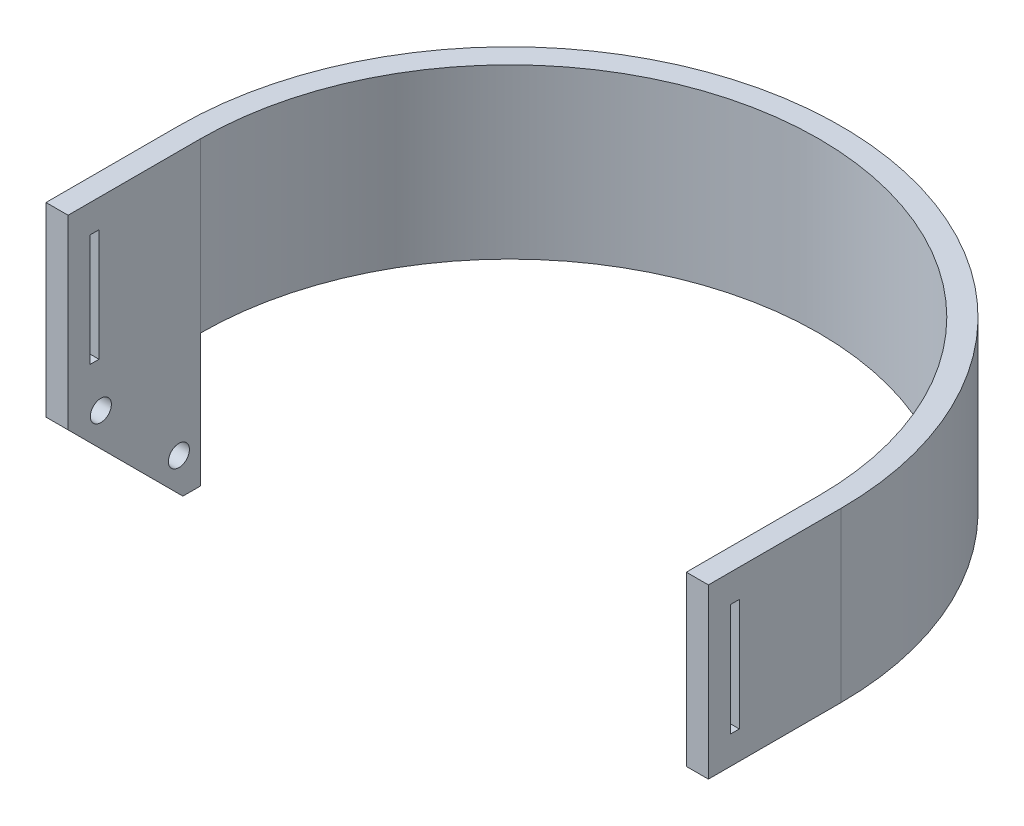
ISO-10303-21;
HEADER;
FILE_DESCRIPTION(('STEP AP214'),'2;1');
FILE_NAME('part.step','',(''),(''),'','','');
FILE_SCHEMA(('AUTOMOTIVE_DESIGN { 1 0 10303 214 1 1 1 1 }'));
ENDSEC;
DATA;
#1=APPLICATION_CONTEXT('core data for automotive mechanical design processes');
#2=APPLICATION_PROTOCOL_DEFINITION('international standard','automotive_design',2000,#1);
#3=PRODUCT_CONTEXT('',#1,'mechanical');
#4=PRODUCT('Part','Part','',(#3));
#5=PRODUCT_RELATED_PRODUCT_CATEGORY('part','',(#4));
#6=PRODUCT_DEFINITION_FORMATION('','',#4);
#7=PRODUCT_DEFINITION_CONTEXT('part definition',#1,'design');
#8=PRODUCT_DEFINITION('design','',#6,#7);
#9=PRODUCT_DEFINITION_SHAPE('','',#8);
#10=(LENGTH_UNIT() NAMED_UNIT(*) SI_UNIT(.MILLI.,.METRE.));
#11=(NAMED_UNIT(*) PLANE_ANGLE_UNIT() SI_UNIT($,.RADIAN.));
#12=(NAMED_UNIT(*) SI_UNIT($,.STERADIAN.) SOLID_ANGLE_UNIT());
#13=UNCERTAINTY_MEASURE_WITH_UNIT(LENGTH_MEASURE(1.E-05),#10,'distance_accuracy_value','');
#14=(GEOMETRIC_REPRESENTATION_CONTEXT(3) GLOBAL_UNCERTAINTY_ASSIGNED_CONTEXT((#13)) GLOBAL_UNIT_ASSIGNED_CONTEXT((#10,
#11,#12)) REPRESENTATION_CONTEXT('',''));
#15=CARTESIAN_POINT('',(0.,0.,0.));
#16=DIRECTION('',(0.,0.,1.));
#17=DIRECTION('',(1.,0.,0.));
#18=AXIS2_PLACEMENT_3D('',#15,#16,#17);
#19=CARTESIAN_POINT('',(0.,38.1,30.));
#20=DIRECTION('',(0.,0.,-1.));
#21=DIRECTION('',(-1.,0.,0.));
#22=AXIS2_PLACEMENT_3D('',#19,#20,#21);
#23=PLANE('',#22);
#24=DIRECTION('',(0.,-1.,0.));
#25=VECTOR('',#24,1.);
#26=CARTESIAN_POINT('',(70.,38.1,30.));
#27=LINE('',#26,#25);
#28=CARTESIAN_POINT('',(70.,38.1,30.));
#29=VERTEX_POINT('',#28);
#30=CARTESIAN_POINT('',(70.,0.,30.));
#31=VERTEX_POINT('',#30);
#32=EDGE_CURVE('E342',#29,#31,#27,.T.);
#33=ORIENTED_EDGE('',*,*,#32,.T.);
#34=DIRECTION('',(1.,0.,0.));
#35=VECTOR('',#34,1.);
#36=CARTESIAN_POINT('',(0.,0.,30.));
#37=LINE('',#36,#35);
#38=CARTESIAN_POINT('',(75.,0.,30.));
#39=VERTEX_POINT('',#38);
#40=EDGE_CURVE('E383',#31,#39,#37,.T.);
#41=ORIENTED_EDGE('',*,*,#40,.T.);
#42=DIRECTION('',(0.,-1.,0.));
#43=VECTOR('',#42,1.);
#44=CARTESIAN_POINT('',(75.,38.1,30.));
#45=LINE('',#44,#43);
#46=CARTESIAN_POINT('',(75.,38.1,30.));
#47=VERTEX_POINT('',#46);
#48=EDGE_CURVE('E338',#47,#39,#45,.T.);
#49=ORIENTED_EDGE('',*,*,#48,.F.);
#50=DIRECTION('',(1.,0.,0.));
#51=VECTOR('',#50,1.);
#52=CARTESIAN_POINT('',(0.,38.1,30.));
#53=LINE('',#52,#51);
#54=EDGE_CURVE('E305',#29,#47,#53,.T.);
#55=ORIENTED_EDGE('',*,*,#54,.F.);
#56=EDGE_LOOP('',(#33,#41,#49,#55));
#57=FACE_BOUND('',#56,.T.);
#58=ADVANCED_FACE('F43',(#57),#23,.F.);
#59=CARTESIAN_POINT('',(0.,0.,0.));
#60=DIRECTION('',(0.,1.,0.));
#61=DIRECTION('',(0.,0.,1.));
#62=AXIS2_PLACEMENT_3D('',#59,#60,#61);
#63=PLANE('',#62);
#64=DIRECTION('',(1.,0.,0.));
#65=VECTOR('',#64,1.);
#66=CARTESIAN_POINT('',(-75.,0.,0.));
#67=LINE('',#66,#65);
#68=CARTESIAN_POINT('',(-75.,0.,0.));
#69=VERTEX_POINT('',#68);
#70=CARTESIAN_POINT('',(-70.,0.,0.));
#71=VERTEX_POINT('',#70);
#72=EDGE_CURVE('E186',#69,#71,#67,.T.);
#73=ORIENTED_EDGE('',*,*,#72,.F.);
#74=CARTESIAN_POINT('',(0.,0.,0.));
#75=DIRECTION('',(0.,1.,0.));
#76=DIRECTION('',(0.,0.,1.));
#77=AXIS2_PLACEMENT_3D('',#74,#75,#76);
#78=CIRCLE('',#77,75.);
#79=CARTESIAN_POINT('',(75.,0.,0.));
#80=VERTEX_POINT('',#79);
#81=EDGE_CURVE('E299',#80,#69,#78,.T.);
#82=ORIENTED_EDGE('',*,*,#81,.F.);
#83=DIRECTION('',(0.,0.,1.));
#84=VECTOR('',#83,1.);
#85=CARTESIAN_POINT('',(75.,0.,0.));
#86=LINE('',#85,#84);
#87=EDGE_CURVE('E179',#80,#39,#86,.T.);
#88=ORIENTED_EDGE('',*,*,#87,.T.);
#89=ORIENTED_EDGE('',*,*,#40,.F.);
#90=DIRECTION('',(0.,0.,1.));
#91=VECTOR('',#90,1.);
#92=CARTESIAN_POINT('',(70.,0.,0.));
#93=LINE('',#92,#91);
#94=CARTESIAN_POINT('',(70.,0.,0.));
#95=VERTEX_POINT('',#94);
#96=EDGE_CURVE('E189',#95,#31,#93,.T.);
#97=ORIENTED_EDGE('',*,*,#96,.F.);
#98=CARTESIAN_POINT('',(0.,0.,0.));
#99=DIRECTION('',(0.,1.,0.));
#100=DIRECTION('',(0.,0.,1.));
#101=AXIS2_PLACEMENT_3D('',#98,#99,#100);
#102=CIRCLE('',#101,70.);
#103=EDGE_CURVE('E183',#95,#71,#102,.T.);
#104=ORIENTED_EDGE('',*,*,#103,.T.);
#105=EDGE_LOOP('',(#73,#82,#88,#89,#97,#104));
#106=FACE_BOUND('',#105,.T.);
#107=ADVANCED_FACE('F184',(#106),#63,.F.);
#108=CARTESIAN_POINT('',(-70.,38.1,0.));
#109=DIRECTION('',(1.,0.,0.));
#110=DIRECTION('',(0.,0.,-1.));
#111=AXIS2_PLACEMENT_3D('',#108,#109,#110);
#112=PLANE('',#111);
#113=DIRECTION('',(0.,-1.,0.));
#114=VECTOR('',#113,1.);
#115=CARTESIAN_POINT('',(-70.,38.1,25.));
#116=LINE('',#115,#114);
#117=CARTESIAN_POINT('',(-70.,31.75,25.));
#118=VERTEX_POINT('',#117);
#119=CARTESIAN_POINT('',(-70.,6.35,25.));
#120=VERTEX_POINT('',#119);
#121=EDGE_CURVE('E193',#118,#120,#116,.T.);
#122=ORIENTED_EDGE('',*,*,#121,.F.);
#123=DIRECTION('',(0.,0.,1.));
#124=VECTOR('',#123,1.);
#125=CARTESIAN_POINT('',(-70.,31.75,0.));
#126=LINE('',#125,#124);
#127=CARTESIAN_POINT('',(-70.,31.75,23.));
#128=VERTEX_POINT('',#127);
#129=EDGE_CURVE('E287',#128,#118,#126,.T.);
#130=ORIENTED_EDGE('',*,*,#129,.F.);
#131=DIRECTION('',(0.,1.,0.));
#132=VECTOR('',#131,1.);
#133=CARTESIAN_POINT('',(-70.,38.1,23.));
#134=LINE('',#133,#132);
#135=CARTESIAN_POINT('',(-70.,6.35,23.));
#136=VERTEX_POINT('',#135);
#137=EDGE_CURVE('E280',#136,#128,#134,.T.);
#138=ORIENTED_EDGE('',*,*,#137,.F.);
#139=DIRECTION('',(0.,0.,-1.));
#140=VECTOR('',#139,1.);
#141=CARTESIAN_POINT('',(-70.,6.35,0.));
#142=LINE('',#141,#140);
#143=EDGE_CURVE('E273',#120,#136,#142,.T.);
#144=ORIENTED_EDGE('',*,*,#143,.F.);
#145=EDGE_LOOP('',(#122,#130,#138,#144));
#146=FACE_BOUND('',#145,.T.);
#147=DIRECTION('',(0.,-1.,0.));
#148=VECTOR('',#147,1.);
#149=CARTESIAN_POINT('',(-70.,38.1,30.));
#150=LINE('',#149,#148);
#151=CARTESIAN_POINT('',(-70.,38.1,30.));
#152=VERTEX_POINT('',#151);
#153=CARTESIAN_POINT('',(-70.,-3.99999999999999,30.));
#154=VERTEX_POINT('',#153);
#155=EDGE_CURVE('E58',#152,#154,#150,.T.);
#156=ORIENTED_EDGE('',*,*,#155,.T.);
#157=DIRECTION('',(0.,-0.707106781186548,-0.707106781186548));
#158=VECTOR('',#157,1.);
#159=CARTESIAN_POINT('',(-70.,-17.,17.));
#160=LINE('',#159,#158);
#161=CARTESIAN_POINT('',(-70.,-30.,3.99999999999999));
#162=VERTEX_POINT('',#161);
#163=EDGE_CURVE('E11',#154,#162,#160,.T.);
#164=ORIENTED_EDGE('',*,*,#163,.T.);
#165=DIRECTION('',(0.,0.,-1.));
#166=VECTOR('',#165,1.);
#167=CARTESIAN_POINT('',(-70.,-30.,0.));
#168=LINE('',#167,#166);
#169=CARTESIAN_POINT('',(-70.,-30.,0.));
#170=VERTEX_POINT('',#169);
#171=EDGE_CURVE('E173',#162,#170,#168,.T.);
#172=ORIENTED_EDGE('',*,*,#171,.T.);
#173=DIRECTION('',(0.,1.,0.));
#174=VECTOR('',#173,1.);
#175=CARTESIAN_POINT('',(-70.,0.,0.));
#176=LINE('',#175,#174);
#177=EDGE_CURVE('E167',#170,#71,#176,.T.);
#178=ORIENTED_EDGE('',*,*,#177,.T.);
#179=DIRECTION('',(0.,-1.,0.));
#180=VECTOR('',#179,1.);
#181=CARTESIAN_POINT('',(-70.,38.1,0.));
#182=LINE('',#181,#180);
#183=CARTESIAN_POINT('',(-70.,38.1,0.));
#184=VERTEX_POINT('',#183);
#185=EDGE_CURVE('E52',#184,#71,#182,.T.);
#186=ORIENTED_EDGE('',*,*,#185,.F.);
#187=DIRECTION('',(0.,0.,1.));
#188=VECTOR('',#187,1.);
#189=CARTESIAN_POINT('',(-70.,38.1,0.));
#190=LINE('',#189,#188);
#191=EDGE_CURVE('E296',#184,#152,#190,.T.);
#192=ORIENTED_EDGE('',*,*,#191,.T.);
#193=EDGE_LOOP('',(#156,#164,#172,#178,#186,#192));
#194=FACE_BOUND('',#193,.T.);
#195=CARTESIAN_POINT('',(-70.,-21.5667568261897,4.89770926787757));
#196=DIRECTION('',(-1.,0.,0.));
#197=DIRECTION('',(0.,0.,1.));
#198=AXIS2_PLACEMENT_3D('',#195,#196,#197);
#199=CIRCLE('',#198,2.38125);
#200=CARTESIAN_POINT('',(-70.,-21.5667568261897,7.27895926787757));
#201=VERTEX_POINT('',#200);
#202=EDGE_CURVE('E391',#201,#201,#199,.F.);
#203=ORIENTED_EDGE('',*,*,#202,.F.);
#204=EDGE_LOOP('',(#203));
#205=FACE_BOUND('',#204,.T.);
#206=CARTESIAN_POINT('',(-70.,-3.88908729652603,22.5753787975413));
#207=DIRECTION('',(-1.,0.,0.));
#208=DIRECTION('',(0.,0.,1.));
#209=AXIS2_PLACEMENT_3D('',#206,#207,#208);
#210=CIRCLE('',#209,2.38125);
#211=CARTESIAN_POINT('',(-70.,-3.88908729652603,24.9566287975413));
#212=VERTEX_POINT('',#211);
#213=EDGE_CURVE('E387',#212,#212,#210,.F.);
#214=ORIENTED_EDGE('',*,*,#213,.F.);
#215=EDGE_LOOP('',(#214));
#216=FACE_BOUND('',#215,.T.);
#217=ADVANCED_FACE('F45',(#146,#194,#205,#216),#112,.T.);
#218=CARTESIAN_POINT('',(0.,38.1,0.));
#219=DIRECTION('',(0.,-1.,0.));
#220=DIRECTION('',(0.,0.,-1.));
#221=AXIS2_PLACEMENT_3D('',#218,#219,#220);
#222=CYLINDRICAL_SURFACE('',#221,70.);
#223=ORIENTED_EDGE('',*,*,#103,.F.);
#224=DIRECTION('',(0.,-1.,0.));
#225=VECTOR('',#224,1.);
#226=CARTESIAN_POINT('',(70.,38.1,0.));
#227=LINE('',#226,#225);
#228=CARTESIAN_POINT('',(70.,38.1,0.));
#229=VERTEX_POINT('',#228);
#230=EDGE_CURVE('E200',#229,#95,#227,.T.);
#231=ORIENTED_EDGE('',*,*,#230,.F.);
#232=CARTESIAN_POINT('',(0.,38.1,0.));
#233=DIRECTION('',(0.,1.,0.));
#234=DIRECTION('',(0.,0.,1.));
#235=AXIS2_PLACEMENT_3D('',#232,#233,#234);
#236=CIRCLE('',#235,70.);
#237=EDGE_CURVE('E198',#229,#184,#236,.T.);
#238=ORIENTED_EDGE('',*,*,#237,.T.);
#239=ORIENTED_EDGE('',*,*,#185,.T.);
#240=EDGE_LOOP('',(#223,#231,#238,#239));
#241=FACE_BOUND('',#240,.T.);
#242=ADVANCED_FACE('F196',(#241),#222,.F.);
#243=CARTESIAN_POINT('',(70.,38.1,0.));
#244=DIRECTION('',(1.,0.,0.));
#245=DIRECTION('',(0.,0.,-1.));
#246=AXIS2_PLACEMENT_3D('',#243,#244,#245);
#247=PLANE('',#246);
#248=DIRECTION('',(0.,0.,1.));
#249=VECTOR('',#248,1.);
#250=CARTESIAN_POINT('',(70.,31.75,0.));
#251=LINE('',#250,#249);
#252=CARTESIAN_POINT('',(70.,31.75,23.));
#253=VERTEX_POINT('',#252);
#254=CARTESIAN_POINT('',(70.,31.75,25.));
#255=VERTEX_POINT('',#254);
#256=EDGE_CURVE('E283',#253,#255,#251,.T.);
#257=ORIENTED_EDGE('',*,*,#256,.T.);
#258=DIRECTION('',(0.,-1.,0.));
#259=VECTOR('',#258,1.);
#260=CARTESIAN_POINT('',(70.,38.1,25.));
#261=LINE('',#260,#259);
#262=CARTESIAN_POINT('',(70.,6.35,25.));
#263=VERTEX_POINT('',#262);
#264=EDGE_CURVE('E290',#255,#263,#261,.T.);
#265=ORIENTED_EDGE('',*,*,#264,.T.);
#266=DIRECTION('',(0.,0.,-1.));
#267=VECTOR('',#266,1.);
#268=CARTESIAN_POINT('',(70.,6.35,0.));
#269=LINE('',#268,#267);
#270=CARTESIAN_POINT('',(70.,6.35,23.));
#271=VERTEX_POINT('',#270);
#272=EDGE_CURVE('E256',#263,#271,#269,.T.);
#273=ORIENTED_EDGE('',*,*,#272,.T.);
#274=DIRECTION('',(0.,1.,0.));
#275=VECTOR('',#274,1.);
#276=CARTESIAN_POINT('',(70.,38.1,23.));
#277=LINE('',#276,#275);
#278=EDGE_CURVE('E276',#271,#253,#277,.T.);
#279=ORIENTED_EDGE('',*,*,#278,.T.);
#280=EDGE_LOOP('',(#257,#265,#273,#279));
#281=FACE_BOUND('',#280,.T.);
#282=ORIENTED_EDGE('',*,*,#96,.T.);
#283=ORIENTED_EDGE('',*,*,#32,.F.);
#284=DIRECTION('',(0.,0.,1.));
#285=VECTOR('',#284,1.);
#286=CARTESIAN_POINT('',(70.,38.1,0.));
#287=LINE('',#286,#285);
#288=EDGE_CURVE('E302',#229,#29,#287,.T.);
#289=ORIENTED_EDGE('',*,*,#288,.F.);
#290=ORIENTED_EDGE('',*,*,#230,.T.);
#291=EDGE_LOOP('',(#282,#283,#289,#290));
#292=FACE_BOUND('',#291,.T.);
#293=ADVANCED_FACE('F349',(#281,#292),#247,.F.);
#294=CARTESIAN_POINT('',(75.,38.1,0.));
#295=DIRECTION('',(1.,0.,0.));
#296=DIRECTION('',(0.,0.,-1.));
#297=AXIS2_PLACEMENT_3D('',#294,#295,#296);
#298=PLANE('',#297);
#299=ORIENTED_EDGE('',*,*,#87,.F.);
#300=DIRECTION('',(0.,-1.,0.));
#301=VECTOR('',#300,1.);
#302=CARTESIAN_POINT('',(75.,38.1,0.));
#303=LINE('',#302,#301);
#304=CARTESIAN_POINT('',(75.,38.1,0.));
#305=VERTEX_POINT('',#304);
#306=EDGE_CURVE('E334',#305,#80,#303,.T.);
#307=ORIENTED_EDGE('',*,*,#306,.F.);
#308=DIRECTION('',(0.,0.,1.));
#309=VECTOR('',#308,1.);
#310=CARTESIAN_POINT('',(75.,38.1,0.));
#311=LINE('',#310,#309);
#312=EDGE_CURVE('E308',#305,#47,#311,.T.);
#313=ORIENTED_EDGE('',*,*,#312,.T.);
#314=ORIENTED_EDGE('',*,*,#48,.T.);
#315=EDGE_LOOP('',(#299,#307,#313,#314));
#316=FACE_BOUND('',#315,.T.);
#317=DIRECTION('',(0.,-1.,0.));
#318=VECTOR('',#317,1.);
#319=CARTESIAN_POINT('',(75.,31.75,25.));
#320=LINE('',#319,#318);
#321=CARTESIAN_POINT('',(75.,31.75,25.));
#322=VERTEX_POINT('',#321);
#323=CARTESIAN_POINT('',(75.,6.35,25.));
#324=VERTEX_POINT('',#323);
#325=EDGE_CURVE('E205',#322,#324,#320,.T.);
#326=ORIENTED_EDGE('',*,*,#325,.F.);
#327=DIRECTION('',(0.,0.,1.));
#328=VECTOR('',#327,1.);
#329=CARTESIAN_POINT('',(75.,31.75,25.));
#330=LINE('',#329,#328);
#331=CARTESIAN_POINT('',(75.,31.75,23.));
#332=VERTEX_POINT('',#331);
#333=EDGE_CURVE('E229',#332,#322,#330,.T.);
#334=ORIENTED_EDGE('',*,*,#333,.F.);
#335=DIRECTION('',(0.,1.,0.));
#336=VECTOR('',#335,1.);
#337=CARTESIAN_POINT('',(75.,31.75,23.));
#338=LINE('',#337,#336);
#339=CARTESIAN_POINT('',(75.,6.35,23.));
#340=VERTEX_POINT('',#339);
#341=EDGE_CURVE('E245',#340,#332,#338,.T.);
#342=ORIENTED_EDGE('',*,*,#341,.F.);
#343=DIRECTION('',(0.,0.,-1.));
#344=VECTOR('',#343,1.);
#345=CARTESIAN_POINT('',(75.,6.35,25.));
#346=LINE('',#345,#344);
#347=EDGE_CURVE('E210',#324,#340,#346,.T.);
#348=ORIENTED_EDGE('',*,*,#347,.F.);
#349=EDGE_LOOP('',(#326,#334,#342,#348));
#350=FACE_BOUND('',#349,.T.);
#351=ADVANCED_FACE('F401',(#316,#350),#298,.T.);
#352=CARTESIAN_POINT('',(0.,38.1,0.));
#353=DIRECTION('',(0.,-1.,0.));
#354=DIRECTION('',(0.,0.,-1.));
#355=AXIS2_PLACEMENT_3D('',#352,#353,#354);
#356=CYLINDRICAL_SURFACE('',#355,75.);
#357=ORIENTED_EDGE('',*,*,#81,.T.);
#358=DIRECTION('',(0.,-1.,0.));
#359=VECTOR('',#358,1.);
#360=CARTESIAN_POINT('',(-75.,38.1,0.));
#361=LINE('',#360,#359);
#362=CARTESIAN_POINT('',(-75.,38.1,0.));
#363=VERTEX_POINT('',#362);
#364=EDGE_CURVE('E330',#363,#69,#361,.T.);
#365=ORIENTED_EDGE('',*,*,#364,.F.);
#366=CARTESIAN_POINT('',(0.,38.1,0.));
#367=DIRECTION('',(0.,1.,0.));
#368=DIRECTION('',(0.,0.,1.));
#369=AXIS2_PLACEMENT_3D('',#366,#367,#368);
#370=CIRCLE('',#369,75.);
#371=EDGE_CURVE('E312',#305,#363,#370,.T.);
#372=ORIENTED_EDGE('',*,*,#371,.F.);
#373=ORIENTED_EDGE('',*,*,#306,.T.);
#374=EDGE_LOOP('',(#357,#365,#372,#373));
#375=FACE_BOUND('',#374,.T.);
#376=ADVANCED_FACE('F407',(#375),#356,.T.);
#377=CARTESIAN_POINT('',(-75.,38.1,0.));
#378=DIRECTION('',(1.,0.,0.));
#379=DIRECTION('',(0.,0.,-1.));
#380=AXIS2_PLACEMENT_3D('',#377,#378,#379);
#381=PLANE('',#380);
#382=DIRECTION('',(0.,0.,1.));
#383=VECTOR('',#382,1.);
#384=CARTESIAN_POINT('',(-75.,31.75,25.));
#385=LINE('',#384,#383);
#386=CARTESIAN_POINT('',(-75.,31.75,23.));
#387=VERTEX_POINT('',#386);
#388=CARTESIAN_POINT('',(-75.,31.75,25.));
#389=VERTEX_POINT('',#388);
#390=EDGE_CURVE('E237',#387,#389,#385,.T.);
#391=ORIENTED_EDGE('',*,*,#390,.T.);
#392=DIRECTION('',(0.,-1.,0.));
#393=VECTOR('',#392,1.);
#394=CARTESIAN_POINT('',(-75.,31.75,25.));
#395=LINE('',#394,#393);
#396=CARTESIAN_POINT('',(-75.,6.35,25.));
#397=VERTEX_POINT('',#396);
#398=EDGE_CURVE('E224',#389,#397,#395,.T.);
#399=ORIENTED_EDGE('',*,*,#398,.T.);
#400=DIRECTION('',(0.,0.,-1.));
#401=VECTOR('',#400,1.);
#402=CARTESIAN_POINT('',(-75.,6.35,25.));
#403=LINE('',#402,#401);
#404=CARTESIAN_POINT('',(-75.,6.35,23.));
#405=VERTEX_POINT('',#404);
#406=EDGE_CURVE('E228',#397,#405,#403,.T.);
#407=ORIENTED_EDGE('',*,*,#406,.T.);
#408=DIRECTION('',(0.,1.,0.));
#409=VECTOR('',#408,1.);
#410=CARTESIAN_POINT('',(-75.,31.75,23.));
#411=LINE('',#410,#409);
#412=EDGE_CURVE('E233',#405,#387,#411,.T.);
#413=ORIENTED_EDGE('',*,*,#412,.T.);
#414=EDGE_LOOP('',(#391,#399,#407,#413));
#415=FACE_BOUND('',#414,.T.);
#416=ORIENTED_EDGE('',*,*,#364,.T.);
#417=DIRECTION('',(0.,-1.,0.));
#418=VECTOR('',#417,1.);
#419=CARTESIAN_POINT('',(-75.,0.,0.));
#420=LINE('',#419,#418);
#421=CARTESIAN_POINT('',(-75.,-30.,0.));
#422=VERTEX_POINT('',#421);
#423=EDGE_CURVE('E203',#69,#422,#420,.T.);
#424=ORIENTED_EDGE('',*,*,#423,.T.);
#425=DIRECTION('',(0.,0.,-1.));
#426=VECTOR('',#425,1.);
#427=CARTESIAN_POINT('',(-75.,-30.,0.));
#428=LINE('',#427,#426);
#429=CARTESIAN_POINT('',(-75.,-30.,3.99999999999999));
#430=VERTEX_POINT('',#429);
#431=EDGE_CURVE('E370',#430,#422,#428,.T.);
#432=ORIENTED_EDGE('',*,*,#431,.F.);
#433=DIRECTION('',(0.,-0.707106781186548,-0.707106781186548));
#434=VECTOR('',#433,1.);
#435=CARTESIAN_POINT('',(-75.,-17.,17.));
#436=LINE('',#435,#434);
#437=CARTESIAN_POINT('',(-75.,-3.99999999999999,30.));
#438=VERTEX_POINT('',#437);
#439=EDGE_CURVE('E364',#438,#430,#436,.T.);
#440=ORIENTED_EDGE('',*,*,#439,.F.);
#441=DIRECTION('',(0.,-1.,0.));
#442=VECTOR('',#441,1.);
#443=CARTESIAN_POINT('',(-75.,38.1,30.));
#444=LINE('',#443,#442);
#445=CARTESIAN_POINT('',(-75.,38.1,30.));
#446=VERTEX_POINT('',#445);
#447=EDGE_CURVE('E327',#446,#438,#444,.T.);
#448=ORIENTED_EDGE('',*,*,#447,.F.);
#449=DIRECTION('',(0.,0.,1.));
#450=VECTOR('',#449,1.);
#451=CARTESIAN_POINT('',(-75.,38.1,0.));
#452=LINE('',#451,#450);
#453=EDGE_CURVE('E315',#363,#446,#452,.T.);
#454=ORIENTED_EDGE('',*,*,#453,.F.);
#455=EDGE_LOOP('',(#416,#424,#432,#440,#448,#454));
#456=FACE_BOUND('',#455,.T.);
#457=CARTESIAN_POINT('',(-75.,-21.5667568261897,4.89770926787757));
#458=DIRECTION('',(1.,0.,0.));
#459=DIRECTION('',(0.,0.,-1.));
#460=AXIS2_PLACEMENT_3D('',#457,#458,#459);
#461=CIRCLE('',#460,2.38125);
#462=CARTESIAN_POINT('',(-75.,-21.5667568261897,2.51645926787756));
#463=VERTEX_POINT('',#462);
#464=EDGE_CURVE('E377',#463,#463,#461,.T.);
#465=ORIENTED_EDGE('',*,*,#464,.T.);
#466=EDGE_LOOP('',(#465));
#467=FACE_BOUND('',#466,.T.);
#468=CARTESIAN_POINT('',(-75.,-3.88908729652603,22.5753787975413));
#469=DIRECTION('',(1.,0.,0.));
#470=DIRECTION('',(0.,0.,-1.));
#471=AXIS2_PLACEMENT_3D('',#468,#469,#470);
#472=CIRCLE('',#471,2.38125);
#473=CARTESIAN_POINT('',(-75.,-3.88908729652603,20.1941287975413));
#474=VERTEX_POINT('',#473);
#475=EDGE_CURVE('E372',#474,#474,#472,.T.);
#476=ORIENTED_EDGE('',*,*,#475,.T.);
#477=EDGE_LOOP('',(#476));
#478=FACE_BOUND('',#477,.T.);
#479=ADVANCED_FACE('F367',(#415,#456,#467,#478),#381,.F.);
#480=DIRECTION('',(1.,0.,0.));
#481=VECTOR('',#480,1.);
#482=CARTESIAN_POINT('',(-75.,-3.99999999999999,30.));
#483=LINE('',#482,#481);
#484=EDGE_CURVE('E220',#438,#154,#483,.T.);
#485=ORIENTED_EDGE('',*,*,#484,.T.);
#486=ORIENTED_EDGE('',*,*,#155,.F.);
#487=DIRECTION('',(1.,0.,0.));
#488=VECTOR('',#487,1.);
#489=CARTESIAN_POINT('',(0.,38.1,30.));
#490=LINE('',#489,#488);
#491=EDGE_CURVE('E318',#446,#152,#490,.T.);
#492=ORIENTED_EDGE('',*,*,#491,.F.);
#493=ORIENTED_EDGE('',*,*,#447,.T.);
#494=EDGE_LOOP('',(#485,#486,#492,#493));
#495=FACE_BOUND('',#494,.T.);
#496=ADVANCED_FACE('F358',(#495),#23,.F.);
#497=CARTESIAN_POINT('',(0.,38.1,0.));
#498=DIRECTION('',(0.,1.,0.));
#499=DIRECTION('',(0.,0.,1.));
#500=AXIS2_PLACEMENT_3D('',#497,#498,#499);
#501=PLANE('',#500);
#502=ORIENTED_EDGE('',*,*,#191,.F.);
#503=ORIENTED_EDGE('',*,*,#237,.F.);
#504=ORIENTED_EDGE('',*,*,#288,.T.);
#505=ORIENTED_EDGE('',*,*,#54,.T.);
#506=ORIENTED_EDGE('',*,*,#312,.F.);
#507=ORIENTED_EDGE('',*,*,#371,.T.);
#508=ORIENTED_EDGE('',*,*,#453,.T.);
#509=ORIENTED_EDGE('',*,*,#491,.T.);
#510=EDGE_LOOP('',(#502,#503,#504,#505,#506,#507,#508,#509));
#511=FACE_BOUND('',#510,.T.);
#512=ADVANCED_FACE('F353',(#511),#501,.T.);
#513=CARTESIAN_POINT('',(-75.,6.35,25.));
#514=DIRECTION('',(0.,-1.,0.));
#515=DIRECTION('',(0.,0.,-1.));
#516=AXIS2_PLACEMENT_3D('',#513,#514,#515);
#517=PLANE('',#516);
#518=ORIENTED_EDGE('',*,*,#143,.T.);
#519=DIRECTION('',(1.,0.,0.));
#520=VECTOR('',#519,1.);
#521=CARTESIAN_POINT('',(-75.,6.35,23.));
#522=LINE('',#521,#520);
#523=EDGE_CURVE('E263',#405,#136,#522,.T.);
#524=ORIENTED_EDGE('',*,*,#523,.F.);
#525=ORIENTED_EDGE('',*,*,#406,.F.);
#526=DIRECTION('',(1.,0.,0.));
#527=VECTOR('',#526,1.);
#528=CARTESIAN_POINT('',(-75.,6.35,25.));
#529=LINE('',#528,#527);
#530=EDGE_CURVE('E66',#397,#120,#529,.T.);
#531=ORIENTED_EDGE('',*,*,#530,.T.);
#532=EDGE_LOOP('',(#518,#524,#525,#531));
#533=FACE_BOUND('',#532,.T.);
#534=ADVANCED_FACE('F436',(#533),#517,.F.);
#535=CARTESIAN_POINT('',(-75.,31.75,23.));
#536=DIRECTION('',(0.,0.,-1.));
#537=DIRECTION('',(0.,1.,0.));
#538=AXIS2_PLACEMENT_3D('',#535,#536,#537);
#539=PLANE('',#538);
#540=ORIENTED_EDGE('',*,*,#137,.T.);
#541=DIRECTION('',(1.,0.,0.));
#542=VECTOR('',#541,1.);
#543=CARTESIAN_POINT('',(-75.,31.75,23.));
#544=LINE('',#543,#542);
#545=EDGE_CURVE('E258',#387,#128,#544,.T.);
#546=ORIENTED_EDGE('',*,*,#545,.F.);
#547=ORIENTED_EDGE('',*,*,#412,.F.);
#548=ORIENTED_EDGE('',*,*,#523,.T.);
#549=EDGE_LOOP('',(#540,#546,#547,#548));
#550=FACE_BOUND('',#549,.T.);
#551=ADVANCED_FACE('F466',(#550),#539,.F.);
#552=CARTESIAN_POINT('',(-75.,31.75,25.));
#553=DIRECTION('',(0.,1.,0.));
#554=DIRECTION('',(0.,0.,1.));
#555=AXIS2_PLACEMENT_3D('',#552,#553,#554);
#556=PLANE('',#555);
#557=ORIENTED_EDGE('',*,*,#129,.T.);
#558=DIRECTION('',(1.,0.,0.));
#559=VECTOR('',#558,1.);
#560=CARTESIAN_POINT('',(-75.,31.75,25.));
#561=LINE('',#560,#559);
#562=EDGE_CURVE('E252',#389,#118,#561,.T.);
#563=ORIENTED_EDGE('',*,*,#562,.F.);
#564=ORIENTED_EDGE('',*,*,#390,.F.);
#565=ORIENTED_EDGE('',*,*,#545,.T.);
#566=EDGE_LOOP('',(#557,#563,#564,#565));
#567=FACE_BOUND('',#566,.T.);
#568=ADVANCED_FACE('F464',(#567),#556,.F.);
#569=CARTESIAN_POINT('',(-75.,31.75,25.));
#570=DIRECTION('',(0.,0.,1.));
#571=DIRECTION('',(0.,-1.,0.));
#572=AXIS2_PLACEMENT_3D('',#569,#570,#571);
#573=PLANE('',#572);
#574=ORIENTED_EDGE('',*,*,#121,.T.);
#575=ORIENTED_EDGE('',*,*,#530,.F.);
#576=ORIENTED_EDGE('',*,*,#398,.F.);
#577=ORIENTED_EDGE('',*,*,#562,.T.);
#578=EDGE_LOOP('',(#574,#575,#576,#577));
#579=FACE_BOUND('',#578,.T.);
#580=ADVANCED_FACE('F460',(#579),#573,.F.);
#581=EDGE_CURVE('E257',#255,#322,#561,.T.);
#582=ORIENTED_EDGE('',*,*,#581,.T.);
#583=ORIENTED_EDGE('',*,*,#325,.T.);
#584=EDGE_CURVE('E240',#263,#324,#529,.T.);
#585=ORIENTED_EDGE('',*,*,#584,.F.);
#586=ORIENTED_EDGE('',*,*,#264,.F.);
#587=EDGE_LOOP('',(#582,#583,#585,#586));
#588=FACE_BOUND('',#587,.T.);
#589=ADVANCED_FACE('F497',(#588),#573,.F.);
#590=EDGE_CURVE('E262',#253,#332,#544,.T.);
#591=ORIENTED_EDGE('',*,*,#590,.T.);
#592=ORIENTED_EDGE('',*,*,#333,.T.);
#593=ORIENTED_EDGE('',*,*,#581,.F.);
#594=ORIENTED_EDGE('',*,*,#256,.F.);
#595=EDGE_LOOP('',(#591,#592,#593,#594));
#596=FACE_BOUND('',#595,.T.);
#597=ADVANCED_FACE('F481',(#596),#556,.F.);
#598=EDGE_CURVE('E267',#271,#340,#522,.T.);
#599=ORIENTED_EDGE('',*,*,#598,.T.);
#600=ORIENTED_EDGE('',*,*,#341,.T.);
#601=ORIENTED_EDGE('',*,*,#590,.F.);
#602=ORIENTED_EDGE('',*,*,#278,.F.);
#603=EDGE_LOOP('',(#599,#600,#601,#602));
#604=FACE_BOUND('',#603,.T.);
#605=ADVANCED_FACE('F474',(#604),#539,.F.);
#606=ORIENTED_EDGE('',*,*,#584,.T.);
#607=ORIENTED_EDGE('',*,*,#347,.T.);
#608=ORIENTED_EDGE('',*,*,#598,.F.);
#609=ORIENTED_EDGE('',*,*,#272,.F.);
#610=EDGE_LOOP('',(#606,#607,#608,#609));
#611=FACE_BOUND('',#610,.T.);
#612=ADVANCED_FACE('F421',(#611),#517,.F.);
#613=CARTESIAN_POINT('',(-75.,0.,0.));
#614=DIRECTION('',(0.,0.,1.));
#615=DIRECTION('',(0.,-1.,0.));
#616=AXIS2_PLACEMENT_3D('',#613,#614,#615);
#617=PLANE('',#616);
#618=ORIENTED_EDGE('',*,*,#72,.T.);
#619=ORIENTED_EDGE('',*,*,#177,.F.);
#620=DIRECTION('',(1.,0.,0.));
#621=VECTOR('',#620,1.);
#622=CARTESIAN_POINT('',(-75.,-30.,0.));
#623=LINE('',#622,#621);
#624=EDGE_CURVE('E206',#422,#170,#623,.T.);
#625=ORIENTED_EDGE('',*,*,#624,.F.);
#626=ORIENTED_EDGE('',*,*,#423,.F.);
#627=EDGE_LOOP('',(#618,#619,#625,#626));
#628=FACE_BOUND('',#627,.T.);
#629=ADVANCED_FACE('F202',(#628),#617,.F.);
#630=CARTESIAN_POINT('',(-75.,-30.,0.));
#631=DIRECTION('',(0.,-1.,0.));
#632=DIRECTION('',(0.,0.,-1.));
#633=AXIS2_PLACEMENT_3D('',#630,#631,#632);
#634=PLANE('',#633);
#635=ORIENTED_EDGE('',*,*,#171,.F.);
#636=DIRECTION('',(1.,0.,0.));
#637=VECTOR('',#636,1.);
#638=CARTESIAN_POINT('',(-75.,-30.,3.99999999999999));
#639=LINE('',#638,#637);
#640=EDGE_CURVE('E212',#430,#162,#639,.T.);
#641=ORIENTED_EDGE('',*,*,#640,.F.);
#642=ORIENTED_EDGE('',*,*,#431,.T.);
#643=ORIENTED_EDGE('',*,*,#624,.T.);
#644=EDGE_LOOP('',(#635,#641,#642,#643));
#645=FACE_BOUND('',#644,.T.);
#646=ADVANCED_FACE('F410',(#645),#634,.T.);
#647=CARTESIAN_POINT('',(-75.,-3.88908729652603,22.5753787975413));
#648=DIRECTION('',(1.,0.,0.));
#649=DIRECTION('',(0.,0.,-1.));
#650=AXIS2_PLACEMENT_3D('',#647,#648,#649);
#651=CYLINDRICAL_SURFACE('',#650,2.38125);
#652=ORIENTED_EDGE('',*,*,#213,.T.);
#653=EDGE_LOOP('',(#652));
#654=FACE_BOUND('',#653,.T.);
#655=ORIENTED_EDGE('',*,*,#475,.F.);
#656=EDGE_LOOP('',(#655));
#657=FACE_BOUND('',#656,.T.);
#658=ADVANCED_FACE('F412',(#654,#657),#651,.F.);
#659=CARTESIAN_POINT('',(-75.,-21.5667568261897,4.89770926787757));
#660=DIRECTION('',(1.,0.,0.));
#661=DIRECTION('',(0.,0.,-1.));
#662=AXIS2_PLACEMENT_3D('',#659,#660,#661);
#663=CYLINDRICAL_SURFACE('',#662,2.38125);
#664=ORIENTED_EDGE('',*,*,#202,.T.);
#665=EDGE_LOOP('',(#664));
#666=FACE_BOUND('',#665,.T.);
#667=ORIENTED_EDGE('',*,*,#464,.F.);
#668=EDGE_LOOP('',(#667));
#669=FACE_BOUND('',#668,.T.);
#670=ADVANCED_FACE('F418',(#666,#669),#663,.F.);
#671=CARTESIAN_POINT('',(-75.,-17.,17.));
#672=DIRECTION('',(0.,-0.707106781186548,0.707106781186548));
#673=DIRECTION('',(0.,-0.707106781186548,-0.707106781186548));
#674=AXIS2_PLACEMENT_3D('',#671,#672,#673);
#675=PLANE('',#674);
#676=ORIENTED_EDGE('',*,*,#163,.F.);
#677=ORIENTED_EDGE('',*,*,#484,.F.);
#678=ORIENTED_EDGE('',*,*,#439,.T.);
#679=ORIENTED_EDGE('',*,*,#640,.T.);
#680=EDGE_LOOP('',(#676,#677,#678,#679));
#681=FACE_BOUND('',#680,.T.);
#682=ADVANCED_FACE('F363',(#681),#675,.T.);
#683=CLOSED_SHELL('',(#58,#107,#217,#242,#293,#351,#376,#479,#496,#512,#534,#551,#568,#580,#589,
#597,#605,#612,#629,#646,#658,#670,#682));
#684=MANIFOLD_SOLID_BREP('B2',#683);
#685=ADVANCED_BREP_SHAPE_REPRESENTATION('',(#18,#684),#14);
#686=SHAPE_DEFINITION_REPRESENTATION(#9,#685);
ENDSEC;
END-ISO-10303-21;
